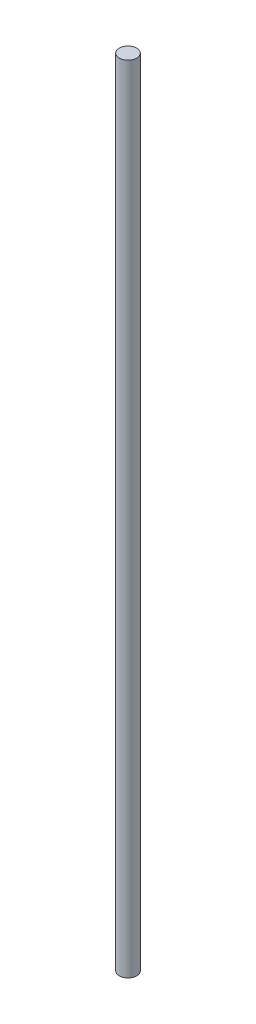
ISO-10303-21;
HEADER;
FILE_DESCRIPTION(('STEP AP214'),'2;1');
FILE_NAME('part.step','',(''),(''),'','','');
FILE_SCHEMA(('AUTOMOTIVE_DESIGN { 1 0 10303 214 1 1 1 1 }'));
ENDSEC;
DATA;
#1=APPLICATION_CONTEXT('core data for automotive mechanical design processes');
#2=APPLICATION_PROTOCOL_DEFINITION('international standard','automotive_design',2000,#1);
#3=PRODUCT_CONTEXT('',#1,'mechanical');
#4=PRODUCT('Part','Part','',(#3));
#5=PRODUCT_RELATED_PRODUCT_CATEGORY('part','',(#4));
#6=PRODUCT_DEFINITION_FORMATION('','',#4);
#7=PRODUCT_DEFINITION_CONTEXT('part definition',#1,'design');
#8=PRODUCT_DEFINITION('design','',#6,#7);
#9=PRODUCT_DEFINITION_SHAPE('','',#8);
#10=(LENGTH_UNIT() NAMED_UNIT(*) SI_UNIT(.MILLI.,.METRE.));
#11=(NAMED_UNIT(*) PLANE_ANGLE_UNIT() SI_UNIT($,.RADIAN.));
#12=(NAMED_UNIT(*) SI_UNIT($,.STERADIAN.) SOLID_ANGLE_UNIT());
#13=UNCERTAINTY_MEASURE_WITH_UNIT(LENGTH_MEASURE(1.E-05),#10,'distance_accuracy_value','');
#14=(GEOMETRIC_REPRESENTATION_CONTEXT(3) GLOBAL_UNCERTAINTY_ASSIGNED_CONTEXT((#13)) GLOBAL_UNIT_ASSIGNED_CONTEXT((#10,
#11,#12)) REPRESENTATION_CONTEXT('',''));
#15=CARTESIAN_POINT('',(0.,0.,0.));
#16=DIRECTION('',(0.,0.,1.));
#17=DIRECTION('',(1.,0.,0.));
#18=AXIS2_PLACEMENT_3D('',#15,#16,#17);
#19=CARTESIAN_POINT('',(0.,228.08,0.));
#20=DIRECTION('',(0.,-1.,0.));
#21=DIRECTION('',(0.,0.,-1.));
#22=AXIS2_PLACEMENT_3D('',#19,#20,#21);
#23=CYLINDRICAL_SURFACE('',#22,2.5);
#24=CARTESIAN_POINT('',(0.,228.08,0.));
#25=DIRECTION('',(0.,1.,0.));
#26=DIRECTION('',(0.,0.,1.));
#27=AXIS2_PLACEMENT_3D('',#24,#25,#26);
#28=CIRCLE('',#27,2.5);
#29=CARTESIAN_POINT('',(0.,228.08,2.5));
#30=VERTEX_POINT('',#29);
#31=EDGE_CURVE('E10',#30,#30,#28,.T.);
#32=ORIENTED_EDGE('',*,*,#31,.F.);
#33=EDGE_LOOP('',(#32));
#34=FACE_BOUND('',#33,.T.);
#35=CARTESIAN_POINT('',(0.,0.,0.));
#36=DIRECTION('',(0.,1.,0.));
#37=DIRECTION('',(0.,0.,1.));
#38=AXIS2_PLACEMENT_3D('',#35,#36,#37);
#39=CIRCLE('',#38,2.5);
#40=CARTESIAN_POINT('',(0.,0.,2.5));
#41=VERTEX_POINT('',#40);
#42=EDGE_CURVE('E44',#41,#41,#39,.T.);
#43=ORIENTED_EDGE('',*,*,#42,.T.);
#44=EDGE_LOOP('',(#43));
#45=FACE_BOUND('',#44,.T.);
#46=ADVANCED_FACE('F41',(#34,#45),#23,.T.);
#47=CARTESIAN_POINT('',(0.,228.08,0.));
#48=DIRECTION('',(0.,1.,0.));
#49=DIRECTION('',(0.,0.,1.));
#50=AXIS2_PLACEMENT_3D('',#47,#48,#49);
#51=PLANE('',#50);
#52=ORIENTED_EDGE('',*,*,#31,.T.);
#53=EDGE_LOOP('',(#52));
#54=FACE_BOUND('',#53,.T.);
#55=ADVANCED_FACE('F58',(#54),#51,.T.);
#56=CARTESIAN_POINT('',(0.,0.,0.));
#57=DIRECTION('',(0.,1.,0.));
#58=DIRECTION('',(0.,0.,1.));
#59=AXIS2_PLACEMENT_3D('',#56,#57,#58);
#60=PLANE('',#59);
#61=ORIENTED_EDGE('',*,*,#42,.F.);
#62=EDGE_LOOP('',(#61));
#63=FACE_BOUND('',#62,.T.);
#64=ADVANCED_FACE('F56',(#63),#60,.F.);
#65=CLOSED_SHELL('',(#46,#55,#64));
#66=MANIFOLD_SOLID_BREP('B2',#65);
#67=ADVANCED_BREP_SHAPE_REPRESENTATION('',(#18,#66),#14);
#68=SHAPE_DEFINITION_REPRESENTATION(#9,#67);
ENDSEC;
END-ISO-10303-21;
